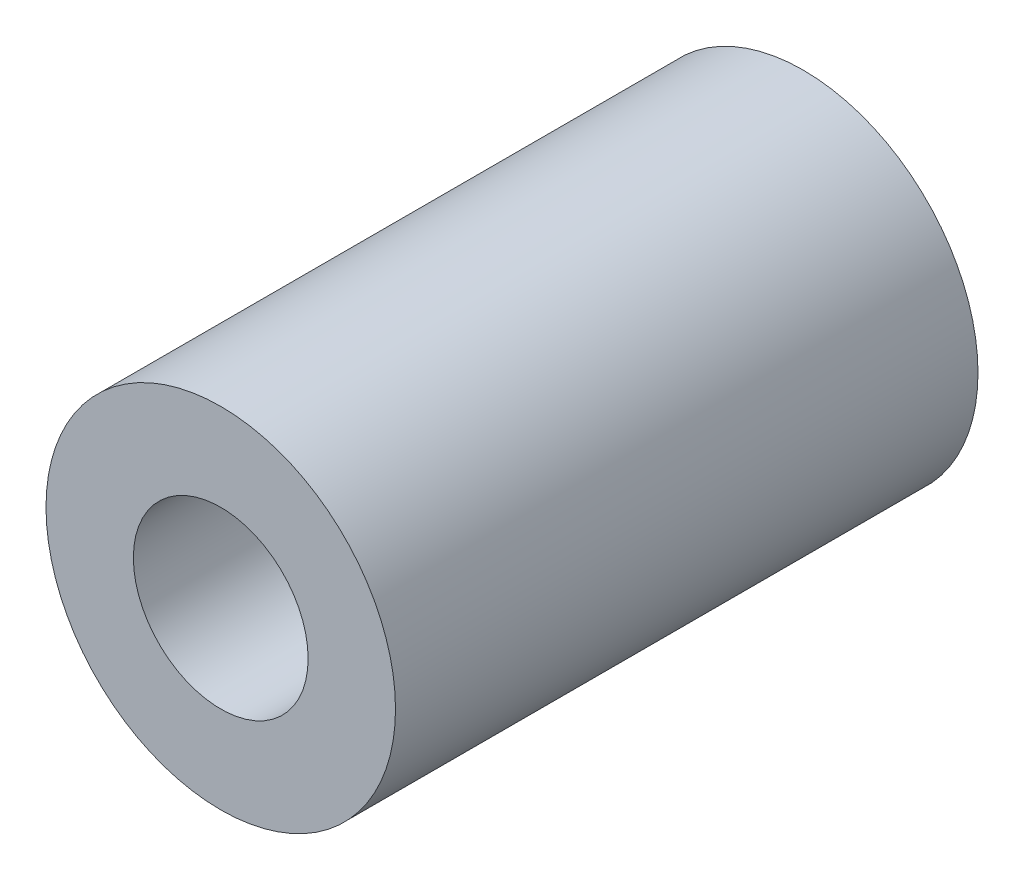
ISO-10303-21;
HEADER;
FILE_DESCRIPTION(('STEP AP214'),'2;1');
FILE_NAME('part.step','',(''),(''),'','','');
FILE_SCHEMA(('AUTOMOTIVE_DESIGN { 1 0 10303 214 1 1 1 1 }'));
ENDSEC;
DATA;
#1=APPLICATION_CONTEXT('core data for automotive mechanical design processes');
#2=APPLICATION_PROTOCOL_DEFINITION('international standard','automotive_design',2000,#1);
#3=PRODUCT_CONTEXT('',#1,'mechanical');
#4=PRODUCT('Part','Part','',(#3));
#5=PRODUCT_RELATED_PRODUCT_CATEGORY('part','',(#4));
#6=PRODUCT_DEFINITION_FORMATION('','',#4);
#7=PRODUCT_DEFINITION_CONTEXT('part definition',#1,'design');
#8=PRODUCT_DEFINITION('design','',#6,#7);
#9=PRODUCT_DEFINITION_SHAPE('','',#8);
#10=(LENGTH_UNIT() NAMED_UNIT(*) SI_UNIT(.MILLI.,.METRE.));
#11=(NAMED_UNIT(*) PLANE_ANGLE_UNIT() SI_UNIT($,.RADIAN.));
#12=(NAMED_UNIT(*) SI_UNIT($,.STERADIAN.) SOLID_ANGLE_UNIT());
#13=UNCERTAINTY_MEASURE_WITH_UNIT(LENGTH_MEASURE(1.E-05),#10,'distance_accuracy_value','');
#14=(GEOMETRIC_REPRESENTATION_CONTEXT(3) GLOBAL_UNCERTAINTY_ASSIGNED_CONTEXT((#13)) GLOBAL_UNIT_ASSIGNED_CONTEXT((#10,
#11,#12)) REPRESENTATION_CONTEXT('',''));
#15=CARTESIAN_POINT('',(0.,0.,0.));
#16=DIRECTION('',(0.,0.,1.));
#17=DIRECTION('',(1.,0.,0.));
#18=AXIS2_PLACEMENT_3D('',#15,#16,#17);
#19=CARTESIAN_POINT('',(0.,0.,10.));
#20=DIRECTION('',(0.,0.,1.));
#21=DIRECTION('',(1.,0.,0.));
#22=AXIS2_PLACEMENT_3D('',#19,#20,#21);
#23=PLANE('',#22);
#24=CARTESIAN_POINT('',(0.,0.,10.));
#25=DIRECTION('',(0.,0.,1.));
#26=DIRECTION('',(1.,0.,0.));
#27=AXIS2_PLACEMENT_3D('',#24,#25,#26);
#28=CIRCLE('',#27,3.);
#29=CARTESIAN_POINT('',(3.,0.,10.));
#30=VERTEX_POINT('',#29);
#31=EDGE_CURVE('E10',#30,#30,#28,.T.);
#32=ORIENTED_EDGE('',*,*,#31,.T.);
#33=EDGE_LOOP('',(#32));
#34=FACE_BOUND('',#33,.T.);
#35=CARTESIAN_POINT('',(0.,0.,10.));
#36=DIRECTION('',(0.,0.,1.));
#37=DIRECTION('',(1.,0.,0.));
#38=AXIS2_PLACEMENT_3D('',#35,#36,#37);
#39=CIRCLE('',#38,1.5);
#40=CARTESIAN_POINT('',(1.5,0.,10.));
#41=VERTEX_POINT('',#40);
#42=EDGE_CURVE('E44',#41,#41,#39,.T.);
#43=ORIENTED_EDGE('',*,*,#42,.F.);
#44=EDGE_LOOP('',(#43));
#45=FACE_BOUND('',#44,.T.);
#46=ADVANCED_FACE('F33',(#34,#45),#23,.T.);
#47=CARTESIAN_POINT('',(0.,0.,0.));
#48=DIRECTION('',(0.,0.,1.));
#49=DIRECTION('',(1.,0.,0.));
#50=AXIS2_PLACEMENT_3D('',#47,#48,#49);
#51=PLANE('',#50);
#52=CARTESIAN_POINT('',(0.,0.,0.));
#53=DIRECTION('',(0.,0.,1.));
#54=DIRECTION('',(1.,0.,0.));
#55=AXIS2_PLACEMENT_3D('',#52,#53,#54);
#56=CIRCLE('',#55,3.);
#57=CARTESIAN_POINT('',(3.,0.,0.));
#58=VERTEX_POINT('',#57);
#59=EDGE_CURVE('E37',#58,#58,#56,.T.);
#60=ORIENTED_EDGE('',*,*,#59,.F.);
#61=EDGE_LOOP('',(#60));
#62=FACE_BOUND('',#61,.T.);
#63=CARTESIAN_POINT('',(0.,0.,0.));
#64=DIRECTION('',(0.,0.,1.));
#65=DIRECTION('',(1.,0.,0.));
#66=AXIS2_PLACEMENT_3D('',#63,#64,#65);
#67=CIRCLE('',#66,1.5);
#68=CARTESIAN_POINT('',(1.5,0.,0.));
#69=VERTEX_POINT('',#68);
#70=EDGE_CURVE('E46',#69,#69,#67,.T.);
#71=ORIENTED_EDGE('',*,*,#70,.T.);
#72=EDGE_LOOP('',(#71));
#73=FACE_BOUND('',#72,.T.);
#74=ADVANCED_FACE('F56',(#62,#73),#51,.F.);
#75=CARTESIAN_POINT('',(0.,0.,10.));
#76=DIRECTION('',(0.,0.,-1.));
#77=DIRECTION('',(-1.,0.,0.));
#78=AXIS2_PLACEMENT_3D('',#75,#76,#77);
#79=CYLINDRICAL_SURFACE('',#78,3.);
#80=ORIENTED_EDGE('',*,*,#31,.F.);
#81=EDGE_LOOP('',(#80));
#82=FACE_BOUND('',#81,.T.);
#83=ORIENTED_EDGE('',*,*,#59,.T.);
#84=EDGE_LOOP('',(#83));
#85=FACE_BOUND('',#84,.T.);
#86=ADVANCED_FACE('F35',(#82,#85),#79,.T.);
#87=CARTESIAN_POINT('',(0.,0.,10.));
#88=DIRECTION('',(0.,0.,-1.));
#89=DIRECTION('',(-1.,0.,0.));
#90=AXIS2_PLACEMENT_3D('',#87,#88,#89);
#91=CYLINDRICAL_SURFACE('',#90,1.5);
#92=ORIENTED_EDGE('',*,*,#42,.T.);
#93=EDGE_LOOP('',(#92));
#94=FACE_BOUND('',#93,.T.);
#95=ORIENTED_EDGE('',*,*,#70,.F.);
#96=EDGE_LOOP('',(#95));
#97=FACE_BOUND('',#96,.T.);
#98=ADVANCED_FACE('F52',(#94,#97),#91,.F.);
#99=CLOSED_SHELL('',(#46,#74,#86,#98));
#100=MANIFOLD_SOLID_BREP('B2',#99);
#101=ADVANCED_BREP_SHAPE_REPRESENTATION('',(#18,#100),#14);
#102=SHAPE_DEFINITION_REPRESENTATION(#9,#101);
ENDSEC;
END-ISO-10303-21;
